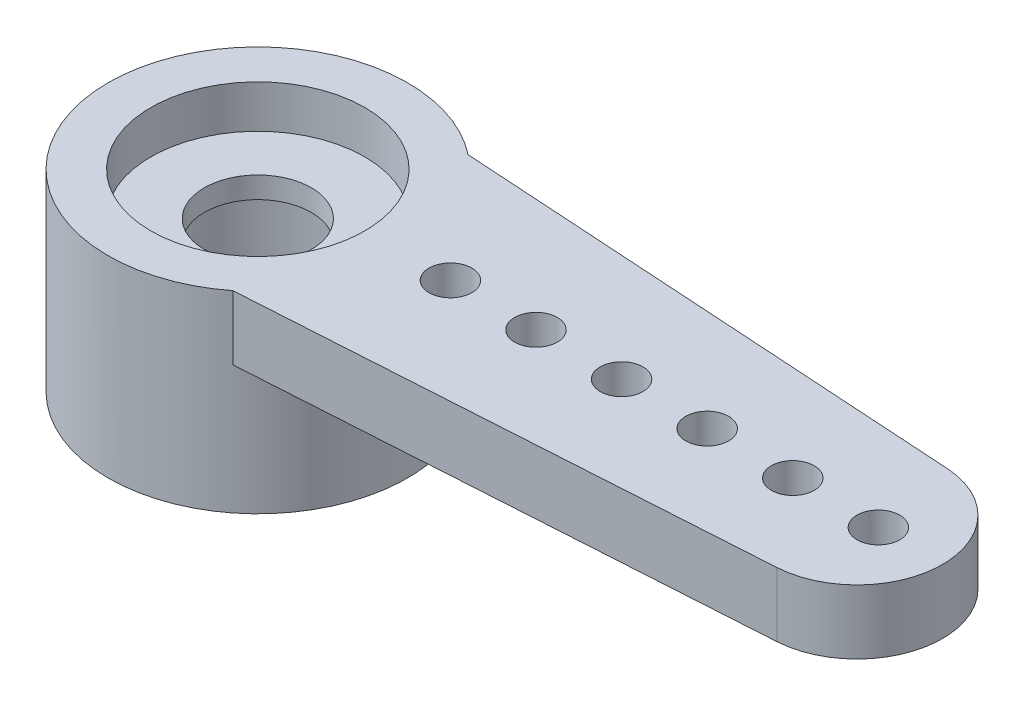
ISO-10303-21;
HEADER;
FILE_DESCRIPTION(('STEP AP214'),'2;1');
FILE_NAME('part.step','',(''),(''),'','','');
FILE_SCHEMA(('AUTOMOTIVE_DESIGN { 1 0 10303 214 1 1 1 1 }'));
ENDSEC;
DATA;
#1=APPLICATION_CONTEXT('core data for automotive mechanical design processes');
#2=APPLICATION_PROTOCOL_DEFINITION('international standard','automotive_design',2000,#1);
#3=PRODUCT_CONTEXT('',#1,'mechanical');
#4=PRODUCT('Part','Part','',(#3));
#5=PRODUCT_RELATED_PRODUCT_CATEGORY('part','',(#4));
#6=PRODUCT_DEFINITION_FORMATION('','',#4);
#7=PRODUCT_DEFINITION_CONTEXT('part definition',#1,'design');
#8=PRODUCT_DEFINITION('design','',#6,#7);
#9=PRODUCT_DEFINITION_SHAPE('','',#8);
#10=(LENGTH_UNIT() NAMED_UNIT(*) SI_UNIT(.MILLI.,.METRE.));
#11=(NAMED_UNIT(*) PLANE_ANGLE_UNIT() SI_UNIT($,.RADIAN.));
#12=(NAMED_UNIT(*) SI_UNIT($,.STERADIAN.) SOLID_ANGLE_UNIT());
#13=UNCERTAINTY_MEASURE_WITH_UNIT(LENGTH_MEASURE(1.E-05),#10,'distance_accuracy_value','');
#14=(GEOMETRIC_REPRESENTATION_CONTEXT(3) GLOBAL_UNCERTAINTY_ASSIGNED_CONTEXT((#13)) GLOBAL_UNIT_ASSIGNED_CONTEXT((#10,
#11,#12)) REPRESENTATION_CONTEXT('',''));
#15=CARTESIAN_POINT('',(0.,0.,0.));
#16=DIRECTION('',(0.,0.,1.));
#17=DIRECTION('',(1.,0.,0.));
#18=AXIS2_PLACEMENT_3D('',#15,#16,#17);
#19=CARTESIAN_POINT('',(0.,4.5,0.));
#20=DIRECTION('',(0.,-1.,0.));
#21=DIRECTION('',(0.,0.,-1.));
#22=AXIS2_PLACEMENT_3D('',#19,#20,#21);
#23=CYLINDRICAL_SURFACE('',#22,3.5);
#24=CARTESIAN_POINT('',(0.,4.5,0.));
#25=DIRECTION('',(0.,1.,0.));
#26=DIRECTION('',(0.,0.,1.));
#27=AXIS2_PLACEMENT_3D('',#24,#25,#26);
#28=CIRCLE('',#27,3.5);
#29=CARTESIAN_POINT('',(2.1650635094611,4.5,-2.75));
#30=VERTEX_POINT('',#29);
#31=CARTESIAN_POINT('',(2.1650635094611,4.5,2.75));
#32=VERTEX_POINT('',#31);
#33=EDGE_CURVE('E11',#30,#32,#28,.T.);
#34=ORIENTED_EDGE('',*,*,#33,.F.);
#35=DIRECTION('',(0.,1.,0.));
#36=VECTOR('',#35,1.);
#37=CARTESIAN_POINT('',(2.1650635094611,3.,-2.75));
#38=LINE('',#37,#36);
#39=CARTESIAN_POINT('',(2.1650635094611,3.,-2.75));
#40=VERTEX_POINT('',#39);
#41=EDGE_CURVE('E105',#40,#30,#38,.T.);
#42=ORIENTED_EDGE('',*,*,#41,.F.);
#43=CARTESIAN_POINT('',(0.,3.,0.));
#44=DIRECTION('',(0.,-1.,0.));
#45=DIRECTION('',(0.,0.,1.));
#46=AXIS2_PLACEMENT_3D('',#43,#44,#45);
#47=CIRCLE('',#46,3.5);
#48=CARTESIAN_POINT('',(2.1650635094611,3.,2.75));
#49=VERTEX_POINT('',#48);
#50=EDGE_CURVE('E57',#40,#49,#47,.T.);
#51=ORIENTED_EDGE('',*,*,#50,.T.);
#52=DIRECTION('',(0.,1.,0.));
#53=VECTOR('',#52,1.);
#54=CARTESIAN_POINT('',(2.1650635094611,3.,2.75));
#55=LINE('',#54,#53);
#56=EDGE_CURVE('E81',#49,#32,#55,.T.);
#57=ORIENTED_EDGE('',*,*,#56,.T.);
#58=EDGE_LOOP('',(#34,#42,#51,#57));
#59=FACE_BOUND('',#58,.T.);
#60=CARTESIAN_POINT('',(0.,0.,0.));
#61=DIRECTION('',(0.,1.,0.));
#62=DIRECTION('',(0.,0.,1.));
#63=AXIS2_PLACEMENT_3D('',#60,#61,#62);
#64=CIRCLE('',#63,3.5);
#65=CARTESIAN_POINT('',(0.,0.,3.5));
#66=VERTEX_POINT('',#65);
#67=EDGE_CURVE('E41',#66,#66,#64,.T.);
#68=ORIENTED_EDGE('',*,*,#67,.T.);
#69=EDGE_LOOP('',(#68));
#70=FACE_BOUND('',#69,.T.);
#71=ADVANCED_FACE('F33',(#59,#70),#23,.T.);
#72=CARTESIAN_POINT('',(0.,4.5,0.));
#73=DIRECTION('',(0.,1.,0.));
#74=DIRECTION('',(0.,0.,1.));
#75=AXIS2_PLACEMENT_3D('',#72,#73,#74);
#76=PLANE('',#75);
#77=CARTESIAN_POINT('',(14.5,4.5,0.));
#78=DIRECTION('',(0.,1.,0.));
#79=DIRECTION('',(0.,0.,1.));
#80=AXIS2_PLACEMENT_3D('',#77,#78,#79);
#81=CIRCLE('',#80,0.500000000000001);
#82=CARTESIAN_POINT('',(14.5,4.5,0.500000000000001));
#83=VERTEX_POINT('',#82);
#84=EDGE_CURVE('E155',#83,#83,#81,.T.);
#85=ORIENTED_EDGE('',*,*,#84,.F.);
#86=EDGE_LOOP('',(#85));
#87=FACE_BOUND('',#86,.T.);
#88=CARTESIAN_POINT('',(12.5,4.5,0.));
#89=DIRECTION('',(0.,1.,0.));
#90=DIRECTION('',(0.,0.,1.));
#91=AXIS2_PLACEMENT_3D('',#88,#89,#90);
#92=CIRCLE('',#91,0.500000000000001);
#93=CARTESIAN_POINT('',(12.5,4.5,0.500000000000001));
#94=VERTEX_POINT('',#93);
#95=EDGE_CURVE('E145',#94,#94,#92,.T.);
#96=ORIENTED_EDGE('',*,*,#95,.F.);
#97=EDGE_LOOP('',(#96));
#98=FACE_BOUND('',#97,.T.);
#99=CARTESIAN_POINT('',(10.5,4.5,0.));
#100=DIRECTION('',(0.,1.,0.));
#101=DIRECTION('',(0.,0.,1.));
#102=AXIS2_PLACEMENT_3D('',#99,#100,#101);
#103=CIRCLE('',#102,0.500000000000001);
#104=CARTESIAN_POINT('',(10.5,4.5,0.500000000000001));
#105=VERTEX_POINT('',#104);
#106=EDGE_CURVE('E142',#105,#105,#103,.T.);
#107=ORIENTED_EDGE('',*,*,#106,.F.);
#108=EDGE_LOOP('',(#107));
#109=FACE_BOUND('',#108,.T.);
#110=CARTESIAN_POINT('',(8.5,4.5,0.));
#111=DIRECTION('',(0.,1.,0.));
#112=DIRECTION('',(0.,0.,1.));
#113=AXIS2_PLACEMENT_3D('',#110,#111,#112);
#114=CIRCLE('',#113,0.500000000000001);
#115=CARTESIAN_POINT('',(8.5,4.5,0.500000000000001));
#116=VERTEX_POINT('',#115);
#117=EDGE_CURVE('E139',#116,#116,#114,.T.);
#118=ORIENTED_EDGE('',*,*,#117,.F.);
#119=EDGE_LOOP('',(#118));
#120=FACE_BOUND('',#119,.T.);
#121=CARTESIAN_POINT('',(6.5,4.5,0.));
#122=DIRECTION('',(0.,1.,0.));
#123=DIRECTION('',(0.,0.,1.));
#124=AXIS2_PLACEMENT_3D('',#121,#122,#123);
#125=CIRCLE('',#124,0.500000000000001);
#126=CARTESIAN_POINT('',(6.5,4.5,0.500000000000001));
#127=VERTEX_POINT('',#126);
#128=EDGE_CURVE('E135',#127,#127,#125,.T.);
#129=ORIENTED_EDGE('',*,*,#128,.F.);
#130=EDGE_LOOP('',(#129));
#131=FACE_BOUND('',#130,.T.);
#132=CARTESIAN_POINT('',(4.5,4.5,0.));
#133=DIRECTION('',(0.,1.,0.));
#134=DIRECTION('',(0.,0.,1.));
#135=AXIS2_PLACEMENT_3D('',#132,#133,#134);
#136=CIRCLE('',#135,0.500000000000001);
#137=CARTESIAN_POINT('',(4.5,4.5,0.500000000000001));
#138=VERTEX_POINT('',#137);
#139=EDGE_CURVE('E131',#138,#138,#136,.T.);
#140=ORIENTED_EDGE('',*,*,#139,.F.);
#141=EDGE_LOOP('',(#140));
#142=FACE_BOUND('',#141,.T.);
#143=CARTESIAN_POINT('',(0.,4.5,0.));
#144=DIRECTION('',(0.,1.,0.));
#145=DIRECTION('',(0.,0.,1.));
#146=AXIS2_PLACEMENT_3D('',#143,#144,#145);
#147=CIRCLE('',#146,2.5);
#148=CARTESIAN_POINT('',(0.,4.5,2.5));
#149=VERTEX_POINT('',#148);
#150=EDGE_CURVE('E116',#149,#149,#147,.T.);
#151=ORIENTED_EDGE('',*,*,#150,.F.);
#152=EDGE_LOOP('',(#151));
#153=FACE_BOUND('',#152,.T.);
#154=ORIENTED_EDGE('',*,*,#33,.T.);
#155=DIRECTION('',(0.998019115161629,0.,-0.0629114120966927));
#156=VECTOR('',#155,1.);
#157=CARTESIAN_POINT('',(2.1650635094611,4.5,2.75));
#158=LINE('',#157,#156);
#159=CARTESIAN_POINT('',(14.1258228241934,4.5,1.99603823032326));
#160=VERTEX_POINT('',#159);
#161=EDGE_CURVE('E100',#32,#160,#158,.T.);
#162=ORIENTED_EDGE('',*,*,#161,.T.);
#163=CARTESIAN_POINT('',(14.,4.5,0.));
#164=DIRECTION('',(0.,1.,0.));
#165=DIRECTION('',(0.,0.,1.));
#166=AXIS2_PLACEMENT_3D('',#163,#164,#165);
#167=CIRCLE('',#166,2.);
#168=CARTESIAN_POINT('',(14.1258228241934,4.5,-1.99603823032326));
#169=VERTEX_POINT('',#168);
#170=EDGE_CURVE('E87',#160,#169,#167,.T.);
#171=ORIENTED_EDGE('',*,*,#170,.T.);
#172=DIRECTION('',(-0.998019115161629,0.,-0.0629114120966927));
#173=VECTOR('',#172,1.);
#174=CARTESIAN_POINT('',(2.1650635094611,4.5,-2.75));
#175=LINE('',#174,#173);
#176=EDGE_CURVE('E48',#169,#30,#175,.T.);
#177=ORIENTED_EDGE('',*,*,#176,.T.);
#178=EDGE_LOOP('',(#154,#162,#171,#177));
#179=FACE_BOUND('',#178,.T.);
#180=ADVANCED_FACE('F167',(#87,#98,#109,#120,#131,#142,#153,#179),#76,.T.);
#181=CARTESIAN_POINT('',(0.,0.,0.));
#182=DIRECTION('',(0.,1.,0.));
#183=DIRECTION('',(0.,0.,1.));
#184=AXIS2_PLACEMENT_3D('',#181,#182,#183);
#185=PLANE('',#184);
#186=CARTESIAN_POINT('',(0.,0.,0.));
#187=DIRECTION('',(0.,-1.,0.));
#188=DIRECTION('',(0.,0.,-1.));
#189=AXIS2_PLACEMENT_3D('',#186,#187,#188);
#190=CIRCLE('',#189,2.5);
#191=CARTESIAN_POINT('',(0.,0.,-2.5));
#192=VERTEX_POINT('',#191);
#193=EDGE_CURVE('E117',#192,#192,#190,.T.);
#194=ORIENTED_EDGE('',*,*,#193,.F.);
#195=EDGE_LOOP('',(#194));
#196=FACE_BOUND('',#195,.T.);
#197=ORIENTED_EDGE('',*,*,#67,.F.);
#198=EDGE_LOOP('',(#197));
#199=FACE_BOUND('',#198,.T.);
#200=ADVANCED_FACE('F170',(#196,#199),#185,.F.);
#201=CARTESIAN_POINT('',(0.,3.5,0.));
#202=DIRECTION('',(0.,1.,0.));
#203=DIRECTION('',(0.,0.,1.));
#204=AXIS2_PLACEMENT_3D('',#201,#202,#203);
#205=CYLINDRICAL_SURFACE('',#204,2.5);
#206=CARTESIAN_POINT('',(0.,3.5,0.));
#207=DIRECTION('',(0.,1.,0.));
#208=DIRECTION('',(0.,0.,1.));
#209=AXIS2_PLACEMENT_3D('',#206,#207,#208);
#210=CIRCLE('',#209,2.5);
#211=CARTESIAN_POINT('',(0.,3.5,2.5));
#212=VERTEX_POINT('',#211);
#213=EDGE_CURVE('E120',#212,#212,#210,.T.);
#214=ORIENTED_EDGE('',*,*,#213,.F.);
#215=EDGE_LOOP('',(#214));
#216=FACE_BOUND('',#215,.T.);
#217=ORIENTED_EDGE('',*,*,#150,.T.);
#218=EDGE_LOOP('',(#217));
#219=FACE_BOUND('',#218,.T.);
#220=ADVANCED_FACE('F208',(#216,#219),#205,.F.);
#221=CARTESIAN_POINT('',(0.,3.5,0.));
#222=DIRECTION('',(0.,1.,0.));
#223=DIRECTION('',(0.,0.,1.));
#224=AXIS2_PLACEMENT_3D('',#221,#222,#223);
#225=PLANE('',#224);
#226=CARTESIAN_POINT('',(0.,3.5,0.));
#227=DIRECTION('',(0.,1.,0.));
#228=DIRECTION('',(0.,0.,1.));
#229=AXIS2_PLACEMENT_3D('',#226,#227,#228);
#230=CIRCLE('',#229,1.25);
#231=CARTESIAN_POINT('',(0.,3.5,1.25));
#232=VERTEX_POINT('',#231);
#233=EDGE_CURVE('E107',#232,#232,#230,.T.);
#234=ORIENTED_EDGE('',*,*,#233,.F.);
#235=EDGE_LOOP('',(#234));
#236=FACE_BOUND('',#235,.T.);
#237=ORIENTED_EDGE('',*,*,#213,.T.);
#238=EDGE_LOOP('',(#237));
#239=FACE_BOUND('',#238,.T.);
#240=ADVANCED_FACE('F216',(#236,#239),#225,.T.);
#241=CARTESIAN_POINT('',(0.,3.,0.));
#242=DIRECTION('',(0.,-1.,0.));
#243=DIRECTION('',(0.,0.,-1.));
#244=AXIS2_PLACEMENT_3D('',#241,#242,#243);
#245=CYLINDRICAL_SURFACE('',#244,2.5);
#246=CARTESIAN_POINT('',(0.,3.,0.));
#247=DIRECTION('',(0.,-1.,0.));
#248=DIRECTION('',(0.,0.,-1.));
#249=AXIS2_PLACEMENT_3D('',#246,#247,#248);
#250=CIRCLE('',#249,2.5);
#251=CARTESIAN_POINT('',(0.,3.,-2.5));
#252=VERTEX_POINT('',#251);
#253=EDGE_CURVE('E113',#252,#252,#250,.T.);
#254=ORIENTED_EDGE('',*,*,#253,.F.);
#255=EDGE_LOOP('',(#254));
#256=FACE_BOUND('',#255,.T.);
#257=ORIENTED_EDGE('',*,*,#193,.T.);
#258=EDGE_LOOP('',(#257));
#259=FACE_BOUND('',#258,.T.);
#260=ADVANCED_FACE('F224',(#256,#259),#245,.F.);
#261=CARTESIAN_POINT('',(0.,3.,0.));
#262=DIRECTION('',(0.,-1.,0.));
#263=DIRECTION('',(0.,0.,-1.));
#264=AXIS2_PLACEMENT_3D('',#261,#262,#263);
#265=PLANE('',#264);
#266=CARTESIAN_POINT('',(0.,3.,0.));
#267=DIRECTION('',(0.,-1.,0.));
#268=DIRECTION('',(0.,0.,-1.));
#269=AXIS2_PLACEMENT_3D('',#266,#267,#268);
#270=CIRCLE('',#269,1.25);
#271=CARTESIAN_POINT('',(0.,3.,-1.25));
#272=VERTEX_POINT('',#271);
#273=EDGE_CURVE('E112',#272,#272,#270,.T.);
#274=ORIENTED_EDGE('',*,*,#273,.F.);
#275=EDGE_LOOP('',(#274));
#276=FACE_BOUND('',#275,.T.);
#277=ORIENTED_EDGE('',*,*,#253,.T.);
#278=EDGE_LOOP('',(#277));
#279=FACE_BOUND('',#278,.T.);
#280=ADVANCED_FACE('F188',(#276,#279),#265,.T.);
#281=CARTESIAN_POINT('',(0.,0.,0.));
#282=DIRECTION('',(0.,1.,0.));
#283=DIRECTION('',(0.,0.,1.));
#284=AXIS2_PLACEMENT_3D('',#281,#282,#283);
#285=CYLINDRICAL_SURFACE('',#284,1.25);
#286=ORIENTED_EDGE('',*,*,#273,.T.);
#287=EDGE_LOOP('',(#286));
#288=FACE_BOUND('',#287,.T.);
#289=ORIENTED_EDGE('',*,*,#233,.T.);
#290=EDGE_LOOP('',(#289));
#291=FACE_BOUND('',#290,.T.);
#292=ADVANCED_FACE('F181',(#288,#291),#285,.F.);
#293=CARTESIAN_POINT('',(2.1650635094611,3.,-2.75));
#294=DIRECTION('',(0.0629114120966926,0.,-0.998019115161629));
#295=DIRECTION('',(-0.998019115161629,0.,-0.0629114120966927));
#296=AXIS2_PLACEMENT_3D('',#293,#294,#295);
#297=PLANE('',#296);
#298=ORIENTED_EDGE('',*,*,#176,.F.);
#299=DIRECTION('',(0.,1.,0.));
#300=VECTOR('',#299,1.);
#301=CARTESIAN_POINT('',(14.1258228241934,3.,-1.99603823032326));
#302=LINE('',#301,#300);
#303=CARTESIAN_POINT('',(14.1258228241934,3.,-1.99603823032326));
#304=VERTEX_POINT('',#303);
#305=EDGE_CURVE('E75',#304,#169,#302,.T.);
#306=ORIENTED_EDGE('',*,*,#305,.F.);
#307=DIRECTION('',(-0.998019115161629,0.,-0.0629114120966927));
#308=VECTOR('',#307,1.);
#309=CARTESIAN_POINT('',(2.1650635094611,3.,-2.75));
#310=LINE('',#309,#308);
#311=EDGE_CURVE('E92',#304,#40,#310,.T.);
#312=ORIENTED_EDGE('',*,*,#311,.T.);
#313=ORIENTED_EDGE('',*,*,#41,.T.);
#314=EDGE_LOOP('',(#298,#306,#312,#313));
#315=FACE_BOUND('',#314,.T.);
#316=ADVANCED_FACE('F179',(#315),#297,.T.);
#317=CARTESIAN_POINT('',(14.,3.,0.));
#318=DIRECTION('',(0.,1.,0.));
#319=DIRECTION('',(0.,0.,1.));
#320=AXIS2_PLACEMENT_3D('',#317,#318,#319);
#321=CYLINDRICAL_SURFACE('',#320,2.);
#322=ORIENTED_EDGE('',*,*,#170,.F.);
#323=DIRECTION('',(0.,1.,0.));
#324=VECTOR('',#323,1.);
#325=CARTESIAN_POINT('',(14.1258228241934,3.,1.99603823032326));
#326=LINE('',#325,#324);
#327=CARTESIAN_POINT('',(14.1258228241934,3.,1.99603823032326));
#328=VERTEX_POINT('',#327);
#329=EDGE_CURVE('E83',#328,#160,#326,.T.);
#330=ORIENTED_EDGE('',*,*,#329,.F.);
#331=CARTESIAN_POINT('',(14.,3.,0.));
#332=DIRECTION('',(0.,1.,0.));
#333=DIRECTION('',(0.,0.,1.));
#334=AXIS2_PLACEMENT_3D('',#331,#332,#333);
#335=CIRCLE('',#334,2.);
#336=EDGE_CURVE('E86',#328,#304,#335,.T.);
#337=ORIENTED_EDGE('',*,*,#336,.T.);
#338=ORIENTED_EDGE('',*,*,#305,.T.);
#339=EDGE_LOOP('',(#322,#330,#337,#338));
#340=FACE_BOUND('',#339,.T.);
#341=ADVANCED_FACE('F85',(#340),#321,.T.);
#342=CARTESIAN_POINT('',(2.1650635094611,3.,2.75));
#343=DIRECTION('',(0.0629114120966926,0.,0.998019115161629));
#344=DIRECTION('',(0.998019115161629,0.,-0.0629114120966927));
#345=AXIS2_PLACEMENT_3D('',#342,#343,#344);
#346=PLANE('',#345);
#347=ORIENTED_EDGE('',*,*,#161,.F.);
#348=ORIENTED_EDGE('',*,*,#56,.F.);
#349=DIRECTION('',(0.998019115161629,0.,-0.0629114120966927));
#350=VECTOR('',#349,1.);
#351=CARTESIAN_POINT('',(2.1650635094611,3.,2.75));
#352=LINE('',#351,#350);
#353=EDGE_CURVE('E91',#49,#328,#352,.T.);
#354=ORIENTED_EDGE('',*,*,#353,.T.);
#355=ORIENTED_EDGE('',*,*,#329,.T.);
#356=EDGE_LOOP('',(#347,#348,#354,#355));
#357=FACE_BOUND('',#356,.T.);
#358=ADVANCED_FACE('F94',(#357),#346,.T.);
#359=CARTESIAN_POINT('',(0.,3.,0.));
#360=DIRECTION('',(0.,1.,0.));
#361=DIRECTION('',(0.,0.,1.));
#362=AXIS2_PLACEMENT_3D('',#359,#360,#361);
#363=PLANE('',#362);
#364=CARTESIAN_POINT('',(14.5,3.,0.));
#365=DIRECTION('',(0.,1.,0.));
#366=DIRECTION('',(0.,0.,1.));
#367=AXIS2_PLACEMENT_3D('',#364,#365,#366);
#368=CIRCLE('',#367,0.500000000000001);
#369=CARTESIAN_POINT('',(14.5,3.,0.500000000000001));
#370=VERTEX_POINT('',#369);
#371=EDGE_CURVE('E36',#370,#370,#368,.T.);
#372=ORIENTED_EDGE('',*,*,#371,.T.);
#373=EDGE_LOOP('',(#372));
#374=FACE_BOUND('',#373,.T.);
#375=CARTESIAN_POINT('',(12.5,3.,0.));
#376=DIRECTION('',(0.,1.,0.));
#377=DIRECTION('',(0.,0.,1.));
#378=AXIS2_PLACEMENT_3D('',#375,#376,#377);
#379=CIRCLE('',#378,0.500000000000001);
#380=CARTESIAN_POINT('',(12.5,3.,0.500000000000001));
#381=VERTEX_POINT('',#380);
#382=EDGE_CURVE('E143',#381,#381,#379,.T.);
#383=ORIENTED_EDGE('',*,*,#382,.T.);
#384=EDGE_LOOP('',(#383));
#385=FACE_BOUND('',#384,.T.);
#386=CARTESIAN_POINT('',(10.5,3.,0.));
#387=DIRECTION('',(0.,1.,0.));
#388=DIRECTION('',(0.,0.,1.));
#389=AXIS2_PLACEMENT_3D('',#386,#387,#388);
#390=CIRCLE('',#389,0.500000000000001);
#391=CARTESIAN_POINT('',(10.5,3.,0.500000000000001));
#392=VERTEX_POINT('',#391);
#393=EDGE_CURVE('E140',#392,#392,#390,.T.);
#394=ORIENTED_EDGE('',*,*,#393,.T.);
#395=EDGE_LOOP('',(#394));
#396=FACE_BOUND('',#395,.T.);
#397=CARTESIAN_POINT('',(8.5,3.,0.));
#398=DIRECTION('',(0.,1.,0.));
#399=DIRECTION('',(0.,0.,1.));
#400=AXIS2_PLACEMENT_3D('',#397,#398,#399);
#401=CIRCLE('',#400,0.500000000000001);
#402=CARTESIAN_POINT('',(8.5,3.,0.500000000000001));
#403=VERTEX_POINT('',#402);
#404=EDGE_CURVE('E136',#403,#403,#401,.T.);
#405=ORIENTED_EDGE('',*,*,#404,.T.);
#406=EDGE_LOOP('',(#405));
#407=FACE_BOUND('',#406,.T.);
#408=CARTESIAN_POINT('',(6.5,3.,0.));
#409=DIRECTION('',(0.,1.,0.));
#410=DIRECTION('',(0.,0.,1.));
#411=AXIS2_PLACEMENT_3D('',#408,#409,#410);
#412=CIRCLE('',#411,0.500000000000001);
#413=CARTESIAN_POINT('',(6.5,3.,0.500000000000001));
#414=VERTEX_POINT('',#413);
#415=EDGE_CURVE('E132',#414,#414,#412,.T.);
#416=ORIENTED_EDGE('',*,*,#415,.T.);
#417=EDGE_LOOP('',(#416));
#418=FACE_BOUND('',#417,.T.);
#419=CARTESIAN_POINT('',(4.5,3.,0.));
#420=DIRECTION('',(0.,1.,0.));
#421=DIRECTION('',(0.,0.,1.));
#422=AXIS2_PLACEMENT_3D('',#419,#420,#421);
#423=CIRCLE('',#422,0.500000000000001);
#424=CARTESIAN_POINT('',(4.5,3.,0.500000000000001));
#425=VERTEX_POINT('',#424);
#426=EDGE_CURVE('E102',#425,#425,#423,.T.);
#427=ORIENTED_EDGE('',*,*,#426,.T.);
#428=EDGE_LOOP('',(#427));
#429=FACE_BOUND('',#428,.T.);
#430=ORIENTED_EDGE('',*,*,#50,.F.);
#431=ORIENTED_EDGE('',*,*,#311,.F.);
#432=ORIENTED_EDGE('',*,*,#336,.F.);
#433=ORIENTED_EDGE('',*,*,#353,.F.);
#434=EDGE_LOOP('',(#430,#431,#432,#433));
#435=FACE_BOUND('',#434,.T.);
#436=ADVANCED_FACE('F90',(#374,#385,#396,#407,#418,#429,#435),#363,.F.);
#437=CARTESIAN_POINT('',(4.5,0.,0.));
#438=DIRECTION('',(0.,1.,0.));
#439=DIRECTION('',(0.,0.,1.));
#440=AXIS2_PLACEMENT_3D('',#437,#438,#439);
#441=CYLINDRICAL_SURFACE('',#440,0.500000000000001);
#442=ORIENTED_EDGE('',*,*,#139,.T.);
#443=EDGE_LOOP('',(#442));
#444=FACE_BOUND('',#443,.T.);
#445=ORIENTED_EDGE('',*,*,#426,.F.);
#446=EDGE_LOOP('',(#445));
#447=FACE_BOUND('',#446,.T.);
#448=ADVANCED_FACE('F164',(#444,#447),#441,.F.);
#449=CARTESIAN_POINT('',(6.5,0.,0.));
#450=DIRECTION('',(0.,1.,0.));
#451=DIRECTION('',(0.,0.,1.));
#452=AXIS2_PLACEMENT_3D('',#449,#450,#451);
#453=CYLINDRICAL_SURFACE('',#452,0.500000000000001);
#454=ORIENTED_EDGE('',*,*,#128,.T.);
#455=EDGE_LOOP('',(#454));
#456=FACE_BOUND('',#455,.T.);
#457=ORIENTED_EDGE('',*,*,#415,.F.);
#458=EDGE_LOOP('',(#457));
#459=FACE_BOUND('',#458,.T.);
#460=ADVANCED_FACE('F280',(#456,#459),#453,.F.);
#461=CARTESIAN_POINT('',(8.5,0.,0.));
#462=DIRECTION('',(0.,1.,0.));
#463=DIRECTION('',(0.,0.,1.));
#464=AXIS2_PLACEMENT_3D('',#461,#462,#463);
#465=CYLINDRICAL_SURFACE('',#464,0.500000000000001);
#466=ORIENTED_EDGE('',*,*,#117,.T.);
#467=EDGE_LOOP('',(#466));
#468=FACE_BOUND('',#467,.T.);
#469=ORIENTED_EDGE('',*,*,#404,.F.);
#470=EDGE_LOOP('',(#469));
#471=FACE_BOUND('',#470,.T.);
#472=ADVANCED_FACE('F288',(#468,#471),#465,.F.);
#473=CARTESIAN_POINT('',(10.5,0.,0.));
#474=DIRECTION('',(0.,1.,0.));
#475=DIRECTION('',(0.,0.,1.));
#476=AXIS2_PLACEMENT_3D('',#473,#474,#475);
#477=CYLINDRICAL_SURFACE('',#476,0.500000000000001);
#478=ORIENTED_EDGE('',*,*,#106,.T.);
#479=EDGE_LOOP('',(#478));
#480=FACE_BOUND('',#479,.T.);
#481=ORIENTED_EDGE('',*,*,#393,.F.);
#482=EDGE_LOOP('',(#481));
#483=FACE_BOUND('',#482,.T.);
#484=ADVANCED_FACE('F297',(#480,#483),#477,.F.);
#485=CARTESIAN_POINT('',(12.5,0.,0.));
#486=DIRECTION('',(0.,1.,0.));
#487=DIRECTION('',(0.,0.,1.));
#488=AXIS2_PLACEMENT_3D('',#485,#486,#487);
#489=CYLINDRICAL_SURFACE('',#488,0.500000000000001);
#490=ORIENTED_EDGE('',*,*,#95,.T.);
#491=EDGE_LOOP('',(#490));
#492=FACE_BOUND('',#491,.T.);
#493=ORIENTED_EDGE('',*,*,#382,.F.);
#494=EDGE_LOOP('',(#493));
#495=FACE_BOUND('',#494,.T.);
#496=ADVANCED_FACE('F306',(#492,#495),#489,.F.);
#497=CARTESIAN_POINT('',(14.5,0.,0.));
#498=DIRECTION('',(0.,1.,0.));
#499=DIRECTION('',(0.,0.,1.));
#500=AXIS2_PLACEMENT_3D('',#497,#498,#499);
#501=CYLINDRICAL_SURFACE('',#500,0.500000000000001);
#502=ORIENTED_EDGE('',*,*,#84,.T.);
#503=EDGE_LOOP('',(#502));
#504=FACE_BOUND('',#503,.T.);
#505=ORIENTED_EDGE('',*,*,#371,.F.);
#506=EDGE_LOOP('',(#505));
#507=FACE_BOUND('',#506,.T.);
#508=ADVANCED_FACE('F315',(#504,#507),#501,.F.);
#509=CLOSED_SHELL('',(#71,#180,#200,#220,#240,#260,#280,#292,#316,#341,#358,#436,#448,#460,#472,
#484,#496,#508));
#510=MANIFOLD_SOLID_BREP('B2',#509);
#511=ADVANCED_BREP_SHAPE_REPRESENTATION('',(#18,#510),#14);
#512=SHAPE_DEFINITION_REPRESENTATION(#9,#511);
ENDSEC;
END-ISO-10303-21;
